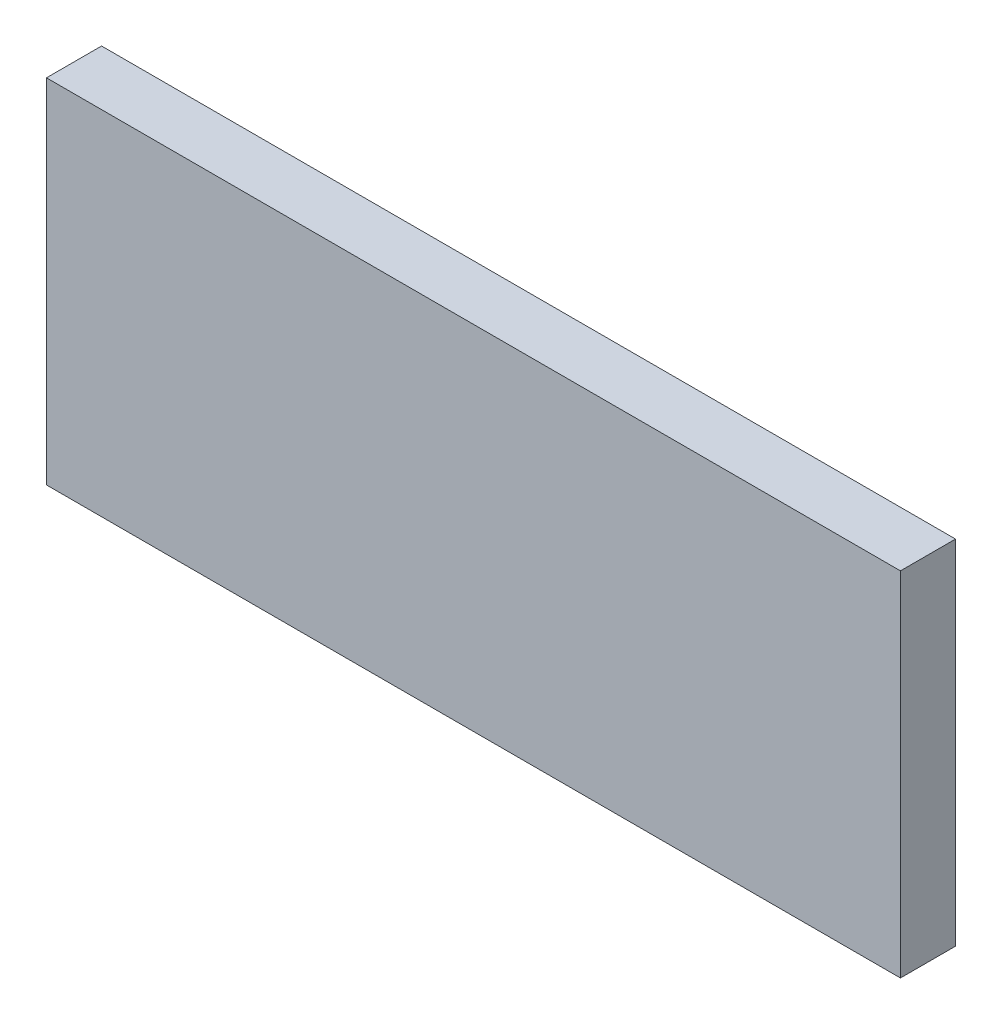
ISO-10303-21;
HEADER;
FILE_DESCRIPTION(('STEP AP214'),'2;1');
FILE_NAME('part.step','',(''),(''),'','','');
FILE_SCHEMA(('AUTOMOTIVE_DESIGN { 1 0 10303 214 1 1 1 1 }'));
ENDSEC;
DATA;
#1=APPLICATION_CONTEXT('core data for automotive mechanical design processes');
#2=APPLICATION_PROTOCOL_DEFINITION('international standard','automotive_design',2000,#1);
#3=PRODUCT_CONTEXT('',#1,'mechanical');
#4=PRODUCT('Part','Part','',(#3));
#5=PRODUCT_RELATED_PRODUCT_CATEGORY('part','',(#4));
#6=PRODUCT_DEFINITION_FORMATION('','',#4);
#7=PRODUCT_DEFINITION_CONTEXT('part definition',#1,'design');
#8=PRODUCT_DEFINITION('design','',#6,#7);
#9=PRODUCT_DEFINITION_SHAPE('','',#8);
#10=(LENGTH_UNIT() NAMED_UNIT(*) SI_UNIT(.MILLI.,.METRE.));
#11=(NAMED_UNIT(*) PLANE_ANGLE_UNIT() SI_UNIT($,.RADIAN.));
#12=(NAMED_UNIT(*) SI_UNIT($,.STERADIAN.) SOLID_ANGLE_UNIT());
#13=UNCERTAINTY_MEASURE_WITH_UNIT(LENGTH_MEASURE(1.E-05),#10,'distance_accuracy_value','');
#14=(GEOMETRIC_REPRESENTATION_CONTEXT(3) GLOBAL_UNCERTAINTY_ASSIGNED_CONTEXT((#13)) GLOBAL_UNIT_ASSIGNED_CONTEXT((#10,
#11,#12)) REPRESENTATION_CONTEXT('',''));
#15=CARTESIAN_POINT('',(0.,0.,0.));
#16=DIRECTION('',(0.,0.,1.));
#17=DIRECTION('',(1.,0.,0.));
#18=AXIS2_PLACEMENT_3D('',#15,#16,#17);
#19=CARTESIAN_POINT('',(0.,0.,10.));
#20=DIRECTION('',(-1.,0.,0.));
#21=DIRECTION('',(0.,-1.,0.));
#22=AXIS2_PLACEMENT_3D('',#19,#20,#21);
#23=PLANE('',#22);
#24=DIRECTION('',(0.,1.,0.));
#25=VECTOR('',#24,1.);
#26=CARTESIAN_POINT('',(0.,0.,0.));
#27=LINE('',#26,#25);
#28=CARTESIAN_POINT('',(0.,0.,0.));
#29=VERTEX_POINT('',#28);
#30=CARTESIAN_POINT('',(0.,64.,0.));
#31=VERTEX_POINT('',#30);
#32=EDGE_CURVE('E107',#29,#31,#27,.T.);
#33=ORIENTED_EDGE('',*,*,#32,.T.);
#34=DIRECTION('',(0.,0.,-1.));
#35=VECTOR('',#34,1.);
#36=CARTESIAN_POINT('',(0.,64.,10.));
#37=LINE('',#36,#35);
#38=CARTESIAN_POINT('',(0.,64.,10.));
#39=VERTEX_POINT('',#38);
#40=EDGE_CURVE('E11',#39,#31,#37,.T.);
#41=ORIENTED_EDGE('',*,*,#40,.F.);
#42=DIRECTION('',(0.,1.,0.));
#43=VECTOR('',#42,1.);
#44=CARTESIAN_POINT('',(0.,0.,10.));
#45=LINE('',#44,#43);
#46=CARTESIAN_POINT('',(0.,0.,10.));
#47=VERTEX_POINT('',#46);
#48=EDGE_CURVE('E91',#47,#39,#45,.T.);
#49=ORIENTED_EDGE('',*,*,#48,.F.);
#50=DIRECTION('',(0.,0.,-1.));
#51=VECTOR('',#50,1.);
#52=CARTESIAN_POINT('',(0.,0.,10.));
#53=LINE('',#52,#51);
#54=EDGE_CURVE('E103',#47,#29,#53,.T.);
#55=ORIENTED_EDGE('',*,*,#54,.T.);
#56=EDGE_LOOP('',(#33,#41,#49,#55));
#57=FACE_BOUND('',#56,.T.);
#58=ADVANCED_FACE('F39',(#57),#23,.F.);
#59=CARTESIAN_POINT('',(0.,64.,10.));
#60=DIRECTION('',(0.,-1.,0.));
#61=DIRECTION('',(1.,0.,0.));
#62=AXIS2_PLACEMENT_3D('',#59,#60,#61);
#63=PLANE('',#62);
#64=DIRECTION('',(-1.,0.,0.));
#65=VECTOR('',#64,1.);
#66=CARTESIAN_POINT('',(0.,64.,0.));
#67=LINE('',#66,#65);
#68=CARTESIAN_POINT('',(-155.,64.,0.));
#69=VERTEX_POINT('',#68);
#70=EDGE_CURVE('E96',#31,#69,#67,.T.);
#71=ORIENTED_EDGE('',*,*,#70,.T.);
#72=DIRECTION('',(0.,0.,-1.));
#73=VECTOR('',#72,1.);
#74=CARTESIAN_POINT('',(-155.,64.,10.));
#75=LINE('',#74,#73);
#76=CARTESIAN_POINT('',(-155.,64.,10.));
#77=VERTEX_POINT('',#76);
#78=EDGE_CURVE('E48',#77,#69,#75,.T.);
#79=ORIENTED_EDGE('',*,*,#78,.F.);
#80=DIRECTION('',(-1.,0.,0.));
#81=VECTOR('',#80,1.);
#82=CARTESIAN_POINT('',(0.,64.,10.));
#83=LINE('',#82,#81);
#84=EDGE_CURVE('E86',#39,#77,#83,.T.);
#85=ORIENTED_EDGE('',*,*,#84,.F.);
#86=ORIENTED_EDGE('',*,*,#40,.T.);
#87=EDGE_LOOP('',(#71,#79,#85,#86));
#88=FACE_BOUND('',#87,.T.);
#89=ADVANCED_FACE('F95',(#88),#63,.F.);
#90=CARTESIAN_POINT('',(-155.,0.,10.));
#91=DIRECTION('',(1.,0.,0.));
#92=DIRECTION('',(0.,0.,-1.));
#93=AXIS2_PLACEMENT_3D('',#90,#91,#92);
#94=PLANE('',#93);
#95=DIRECTION('',(0.,-1.,0.));
#96=VECTOR('',#95,1.);
#97=CARTESIAN_POINT('',(-155.,0.,0.));
#98=LINE('',#97,#96);
#99=CARTESIAN_POINT('',(-155.,0.,0.));
#100=VERTEX_POINT('',#99);
#101=EDGE_CURVE('E73',#69,#100,#98,.T.);
#102=ORIENTED_EDGE('',*,*,#101,.T.);
#103=DIRECTION('',(0.,0.,-1.));
#104=VECTOR('',#103,1.);
#105=CARTESIAN_POINT('',(-155.,0.,10.));
#106=LINE('',#105,#104);
#107=CARTESIAN_POINT('',(-155.,0.,10.));
#108=VERTEX_POINT('',#107);
#109=EDGE_CURVE('E98',#108,#100,#106,.T.);
#110=ORIENTED_EDGE('',*,*,#109,.F.);
#111=DIRECTION('',(0.,-1.,0.));
#112=VECTOR('',#111,1.);
#113=CARTESIAN_POINT('',(-155.,0.,10.));
#114=LINE('',#113,#112);
#115=EDGE_CURVE('E89',#77,#108,#114,.T.);
#116=ORIENTED_EDGE('',*,*,#115,.F.);
#117=ORIENTED_EDGE('',*,*,#78,.T.);
#118=EDGE_LOOP('',(#102,#110,#116,#117));
#119=FACE_BOUND('',#118,.T.);
#120=ADVANCED_FACE('F99',(#119),#94,.F.);
#121=CARTESIAN_POINT('',(0.,0.,10.));
#122=DIRECTION('',(0.,1.,0.));
#123=DIRECTION('',(0.,0.,1.));
#124=AXIS2_PLACEMENT_3D('',#121,#122,#123);
#125=PLANE('',#124);
#126=DIRECTION('',(1.,0.,0.));
#127=VECTOR('',#126,1.);
#128=CARTESIAN_POINT('',(0.,0.,0.));
#129=LINE('',#128,#127);
#130=EDGE_CURVE('E79',#100,#29,#129,.T.);
#131=ORIENTED_EDGE('',*,*,#130,.T.);
#132=ORIENTED_EDGE('',*,*,#54,.F.);
#133=DIRECTION('',(1.,0.,0.));
#134=VECTOR('',#133,1.);
#135=CARTESIAN_POINT('',(0.,0.,10.));
#136=LINE('',#135,#134);
#137=EDGE_CURVE('E56',#108,#47,#136,.T.);
#138=ORIENTED_EDGE('',*,*,#137,.F.);
#139=ORIENTED_EDGE('',*,*,#109,.T.);
#140=EDGE_LOOP('',(#131,#132,#138,#139));
#141=FACE_BOUND('',#140,.T.);
#142=ADVANCED_FACE('F120',(#141),#125,.F.);
#143=CARTESIAN_POINT('',(0.,0.,10.));
#144=DIRECTION('',(0.,0.,1.));
#145=DIRECTION('',(1.,0.,0.));
#146=AXIS2_PLACEMENT_3D('',#143,#144,#145);
#147=PLANE('',#146);
#148=ORIENTED_EDGE('',*,*,#48,.T.);
#149=ORIENTED_EDGE('',*,*,#84,.T.);
#150=ORIENTED_EDGE('',*,*,#115,.T.);
#151=ORIENTED_EDGE('',*,*,#137,.T.);
#152=EDGE_LOOP('',(#148,#149,#150,#151));
#153=FACE_BOUND('',#152,.T.);
#154=ADVANCED_FACE('F87',(#153),#147,.T.);
#155=CARTESIAN_POINT('',(0.,0.,0.));
#156=DIRECTION('',(0.,0.,1.));
#157=DIRECTION('',(1.,0.,0.));
#158=AXIS2_PLACEMENT_3D('',#155,#156,#157);
#159=PLANE('',#158);
#160=ORIENTED_EDGE('',*,*,#32,.F.);
#161=ORIENTED_EDGE('',*,*,#130,.F.);
#162=ORIENTED_EDGE('',*,*,#101,.F.);
#163=ORIENTED_EDGE('',*,*,#70,.F.);
#164=EDGE_LOOP('',(#160,#161,#162,#163));
#165=FACE_BOUND('',#164,.T.);
#166=ADVANCED_FACE('F123',(#165),#159,.F.);
#167=CLOSED_SHELL('',(#58,#89,#120,#142,#154,#166));
#168=MANIFOLD_SOLID_BREP('B2',#167);
#169=ADVANCED_BREP_SHAPE_REPRESENTATION('',(#18,#168),#14);
#170=SHAPE_DEFINITION_REPRESENTATION(#9,#169);
ENDSEC;
END-ISO-10303-21;
